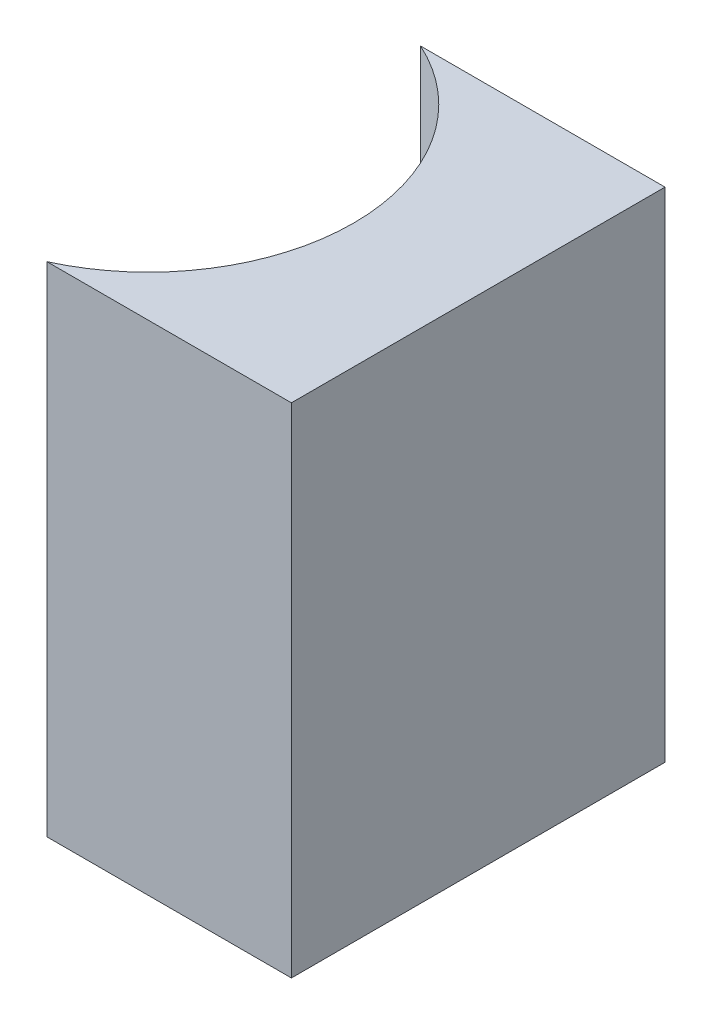
ISO-10303-21;
HEADER;
FILE_DESCRIPTION(('STEP AP214'),'2;1');
FILE_NAME('part.step','',(''),(''),'','','');
FILE_SCHEMA(('AUTOMOTIVE_DESIGN { 1 0 10303 214 1 1 1 1 }'));
ENDSEC;
DATA;
#1=APPLICATION_CONTEXT('core data for automotive mechanical design processes');
#2=APPLICATION_PROTOCOL_DEFINITION('international standard','automotive_design',2000,#1);
#3=PRODUCT_CONTEXT('',#1,'mechanical');
#4=PRODUCT('Part','Part','',(#3));
#5=PRODUCT_RELATED_PRODUCT_CATEGORY('part','',(#4));
#6=PRODUCT_DEFINITION_FORMATION('','',#4);
#7=PRODUCT_DEFINITION_CONTEXT('part definition',#1,'design');
#8=PRODUCT_DEFINITION('design','',#6,#7);
#9=PRODUCT_DEFINITION_SHAPE('','',#8);
#10=(LENGTH_UNIT() NAMED_UNIT(*) SI_UNIT(.MILLI.,.METRE.));
#11=(NAMED_UNIT(*) PLANE_ANGLE_UNIT() SI_UNIT($,.RADIAN.));
#12=(NAMED_UNIT(*) SI_UNIT($,.STERADIAN.) SOLID_ANGLE_UNIT());
#13=UNCERTAINTY_MEASURE_WITH_UNIT(LENGTH_MEASURE(1.E-05),#10,'distance_accuracy_value','');
#14=(GEOMETRIC_REPRESENTATION_CONTEXT(3) GLOBAL_UNCERTAINTY_ASSIGNED_CONTEXT((#13)) GLOBAL_UNIT_ASSIGNED_CONTEXT((#10,
#11,#12)) REPRESENTATION_CONTEXT('',''));
#15=CARTESIAN_POINT('',(0.,0.,0.));
#16=DIRECTION('',(0.,0.,1.));
#17=DIRECTION('',(1.,0.,0.));
#18=AXIS2_PLACEMENT_3D('',#15,#16,#17);
#19=CARTESIAN_POINT('',(0.,8.,0.));
#20=DIRECTION('',(0.,0.,1.));
#21=DIRECTION('',(1.,0.,0.));
#22=AXIS2_PLACEMENT_3D('',#19,#20,#21);
#23=PLANE('',#22);
#24=DIRECTION('',(-1.,0.,0.));
#25=VECTOR('',#24,1.);
#26=CARTESIAN_POINT('',(0.,0.,0.));
#27=LINE('',#26,#25);
#28=CARTESIAN_POINT('',(0.,0.,0.));
#29=VERTEX_POINT('',#28);
#30=CARTESIAN_POINT('',(-3.92522729151325,0.,0.));
#31=VERTEX_POINT('',#30);
#32=EDGE_CURVE('E100',#29,#31,#27,.T.);
#33=ORIENTED_EDGE('',*,*,#32,.T.);
#34=DIRECTION('',(0.,-1.,0.));
#35=VECTOR('',#34,1.);
#36=CARTESIAN_POINT('',(-3.92522729151325,8.,0.));
#37=LINE('',#36,#35);
#38=CARTESIAN_POINT('',(-3.92522729151325,8.,0.));
#39=VERTEX_POINT('',#38);
#40=EDGE_CURVE('E11',#39,#31,#37,.T.);
#41=ORIENTED_EDGE('',*,*,#40,.F.);
#42=DIRECTION('',(-1.,0.,0.));
#43=VECTOR('',#42,1.);
#44=CARTESIAN_POINT('',(0.,8.,0.));
#45=LINE('',#44,#43);
#46=CARTESIAN_POINT('',(0.,8.,0.));
#47=VERTEX_POINT('',#46);
#48=EDGE_CURVE('E88',#47,#39,#45,.T.);
#49=ORIENTED_EDGE('',*,*,#48,.F.);
#50=DIRECTION('',(0.,-1.,0.));
#51=VECTOR('',#50,1.);
#52=CARTESIAN_POINT('',(0.,8.,0.));
#53=LINE('',#52,#51);
#54=EDGE_CURVE('E96',#47,#29,#53,.T.);
#55=ORIENTED_EDGE('',*,*,#54,.T.);
#56=EDGE_LOOP('',(#33,#41,#49,#55));
#57=FACE_BOUND('',#56,.T.);
#58=ADVANCED_FACE('F37',(#57),#23,.F.);
#59=CARTESIAN_POINT('',(-5.3,8.,3.));
#60=DIRECTION('',(0.,-1.,0.));
#61=DIRECTION('',(0.,0.,-1.));
#62=AXIS2_PLACEMENT_3D('',#59,#60,#61);
#63=CYLINDRICAL_SURFACE('',#62,3.3);
#64=CARTESIAN_POINT('',(-5.3,0.,3.));
#65=DIRECTION('',(0.,-1.,0.));
#66=DIRECTION('',(0.,0.,1.));
#67=AXIS2_PLACEMENT_3D('',#64,#65,#66);
#68=CIRCLE('',#67,3.3);
#69=CARTESIAN_POINT('',(-3.92522729151325,0.,6.));
#70=VERTEX_POINT('',#69);
#71=EDGE_CURVE('E92',#31,#70,#68,.T.);
#72=ORIENTED_EDGE('',*,*,#71,.T.);
#73=DIRECTION('',(0.,-1.,0.));
#74=VECTOR('',#73,1.);
#75=CARTESIAN_POINT('',(-3.92522729151325,8.,6.));
#76=LINE('',#75,#74);
#77=CARTESIAN_POINT('',(-3.92522729151325,8.,6.));
#78=VERTEX_POINT('',#77);
#79=EDGE_CURVE('E45',#78,#70,#76,.T.);
#80=ORIENTED_EDGE('',*,*,#79,.F.);
#81=CARTESIAN_POINT('',(-5.3,8.,3.));
#82=DIRECTION('',(0.,-1.,0.));
#83=DIRECTION('',(0.,0.,1.));
#84=AXIS2_PLACEMENT_3D('',#81,#82,#83);
#85=CIRCLE('',#84,3.3);
#86=EDGE_CURVE('E83',#39,#78,#85,.T.);
#87=ORIENTED_EDGE('',*,*,#86,.F.);
#88=ORIENTED_EDGE('',*,*,#40,.T.);
#89=EDGE_LOOP('',(#72,#80,#87,#88));
#90=FACE_BOUND('',#89,.T.);
#91=ADVANCED_FACE('F91',(#90),#63,.F.);
#92=CARTESIAN_POINT('',(0.,8.,6.));
#93=DIRECTION('',(0.,0.,-1.));
#94=DIRECTION('',(-1.,0.,0.));
#95=AXIS2_PLACEMENT_3D('',#92,#93,#94);
#96=PLANE('',#95);
#97=DIRECTION('',(1.,0.,0.));
#98=VECTOR('',#97,1.);
#99=CARTESIAN_POINT('',(0.,0.,6.));
#100=LINE('',#99,#98);
#101=CARTESIAN_POINT('',(0.,0.,6.));
#102=VERTEX_POINT('',#101);
#103=EDGE_CURVE('E70',#70,#102,#100,.T.);
#104=ORIENTED_EDGE('',*,*,#103,.T.);
#105=DIRECTION('',(0.,-1.,0.));
#106=VECTOR('',#105,1.);
#107=CARTESIAN_POINT('',(0.,8.,6.));
#108=LINE('',#107,#106);
#109=CARTESIAN_POINT('',(0.,8.,6.));
#110=VERTEX_POINT('',#109);
#111=EDGE_CURVE('E93',#110,#102,#108,.T.);
#112=ORIENTED_EDGE('',*,*,#111,.F.);
#113=DIRECTION('',(1.,0.,0.));
#114=VECTOR('',#113,1.);
#115=CARTESIAN_POINT('',(0.,8.,6.));
#116=LINE('',#115,#114);
#117=EDGE_CURVE('E86',#78,#110,#116,.T.);
#118=ORIENTED_EDGE('',*,*,#117,.F.);
#119=ORIENTED_EDGE('',*,*,#79,.T.);
#120=EDGE_LOOP('',(#104,#112,#118,#119));
#121=FACE_BOUND('',#120,.T.);
#122=ADVANCED_FACE('F94',(#121),#96,.F.);
#123=CARTESIAN_POINT('',(0.,8.,0.));
#124=DIRECTION('',(-1.,0.,0.));
#125=DIRECTION('',(0.,0.,1.));
#126=AXIS2_PLACEMENT_3D('',#123,#124,#125);
#127=PLANE('',#126);
#128=DIRECTION('',(0.,0.,-1.));
#129=VECTOR('',#128,1.);
#130=CARTESIAN_POINT('',(0.,0.,0.));
#131=LINE('',#130,#129);
#132=EDGE_CURVE('E76',#102,#29,#131,.T.);
#133=ORIENTED_EDGE('',*,*,#132,.T.);
#134=ORIENTED_EDGE('',*,*,#54,.F.);
#135=DIRECTION('',(0.,0.,-1.));
#136=VECTOR('',#135,1.);
#137=CARTESIAN_POINT('',(0.,8.,0.));
#138=LINE('',#137,#136);
#139=EDGE_CURVE('E53',#110,#47,#138,.T.);
#140=ORIENTED_EDGE('',*,*,#139,.F.);
#141=ORIENTED_EDGE('',*,*,#111,.T.);
#142=EDGE_LOOP('',(#133,#134,#140,#141));
#143=FACE_BOUND('',#142,.T.);
#144=ADVANCED_FACE('F107',(#143),#127,.F.);
#145=CARTESIAN_POINT('',(-5.3,8.,3.));
#146=DIRECTION('',(0.,1.,0.));
#147=DIRECTION('',(0.,0.,1.));
#148=AXIS2_PLACEMENT_3D('',#145,#146,#147);
#149=PLANE('',#148);
#150=ORIENTED_EDGE('',*,*,#48,.T.);
#151=ORIENTED_EDGE('',*,*,#86,.T.);
#152=ORIENTED_EDGE('',*,*,#117,.T.);
#153=ORIENTED_EDGE('',*,*,#139,.T.);
#154=EDGE_LOOP('',(#150,#151,#152,#153));
#155=FACE_BOUND('',#154,.T.);
#156=ADVANCED_FACE('F84',(#155),#149,.T.);
#157=CARTESIAN_POINT('',(-5.3,0.,3.));
#158=DIRECTION('',(0.,1.,0.));
#159=DIRECTION('',(0.,0.,1.));
#160=AXIS2_PLACEMENT_3D('',#157,#158,#159);
#161=PLANE('',#160);
#162=ORIENTED_EDGE('',*,*,#32,.F.);
#163=ORIENTED_EDGE('',*,*,#132,.F.);
#164=ORIENTED_EDGE('',*,*,#103,.F.);
#165=ORIENTED_EDGE('',*,*,#71,.F.);
#166=EDGE_LOOP('',(#162,#163,#164,#165));
#167=FACE_BOUND('',#166,.T.);
#168=ADVANCED_FACE('F110',(#167),#161,.F.);
#169=CLOSED_SHELL('',(#58,#91,#122,#144,#156,#168));
#170=MANIFOLD_SOLID_BREP('B2',#169);
#171=ADVANCED_BREP_SHAPE_REPRESENTATION('',(#18,#170),#14);
#172=SHAPE_DEFINITION_REPRESENTATION(#9,#171);
ENDSEC;
END-ISO-10303-21;
